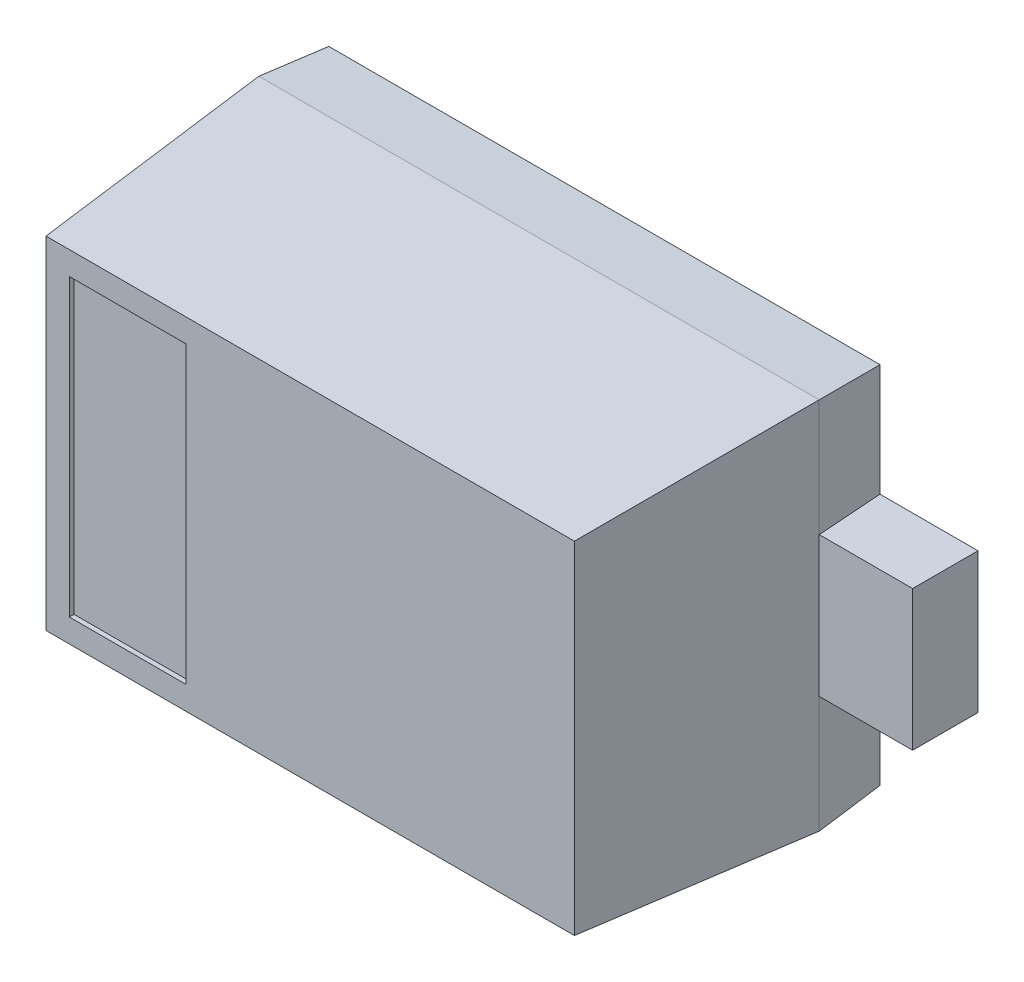
ISO-10303-21;
HEADER;
FILE_DESCRIPTION(('STEP AP214'),'2;1');
FILE_NAME('part.step','',(''),(''),'','','');
FILE_SCHEMA(('AUTOMOTIVE_DESIGN { 1 0 10303 214 1 1 1 1 }'));
ENDSEC;
DATA;
#1=APPLICATION_CONTEXT('core data for automotive mechanical design processes');
#2=APPLICATION_PROTOCOL_DEFINITION('international standard','automotive_design',2000,#1);
#3=PRODUCT_CONTEXT('',#1,'mechanical');
#4=PRODUCT('Part','Part','',(#3));
#5=PRODUCT_RELATED_PRODUCT_CATEGORY('part','',(#4));
#6=PRODUCT_DEFINITION_FORMATION('','',#4);
#7=PRODUCT_DEFINITION_CONTEXT('part definition',#1,'design');
#8=PRODUCT_DEFINITION('design','',#6,#7);
#9=PRODUCT_DEFINITION_SHAPE('','',#8);
#10=(LENGTH_UNIT() NAMED_UNIT(*) SI_UNIT(.MILLI.,.METRE.));
#11=(NAMED_UNIT(*) PLANE_ANGLE_UNIT() SI_UNIT($,.RADIAN.));
#12=(NAMED_UNIT(*) SI_UNIT($,.STERADIAN.) SOLID_ANGLE_UNIT());
#13=UNCERTAINTY_MEASURE_WITH_UNIT(LENGTH_MEASURE(1.E-05),#10,'distance_accuracy_value','');
#14=(GEOMETRIC_REPRESENTATION_CONTEXT(3) GLOBAL_UNCERTAINTY_ASSIGNED_CONTEXT((#13)) GLOBAL_UNIT_ASSIGNED_CONTEXT((#10,
#11,#12)) REPRESENTATION_CONTEXT('',''));
#15=CARTESIAN_POINT('',(0.,0.,0.));
#16=DIRECTION('',(0.,0.,1.));
#17=DIRECTION('',(1.,0.,0.));
#18=AXIS2_PLACEMENT_3D('',#15,#16,#17);
#19=CARTESIAN_POINT('',(0.8,-0.15,0.));
#20=DIRECTION('',(1.,0.,0.));
#21=DIRECTION('',(0.,0.,1.));
#22=AXIS2_PLACEMENT_3D('',#19,#20,#21);
#23=PLANE('',#22);
#24=DIRECTION('',(0.,0.,1.));
#25=VECTOR('',#24,1.);
#26=CARTESIAN_POINT('',(0.8,-0.15,0.));
#27=LINE('',#26,#25);
#28=CARTESIAN_POINT('',(0.8,-0.15,0.));
#29=VERTEX_POINT('',#28);
#30=CARTESIAN_POINT('',(0.8,-0.15,0.14));
#31=VERTEX_POINT('',#30);
#32=EDGE_CURVE('E11',#29,#31,#27,.T.);
#33=ORIENTED_EDGE('',*,*,#32,.F.);
#34=DIRECTION('',(0.,1.,0.));
#35=VECTOR('',#34,1.);
#36=CARTESIAN_POINT('',(0.8,-0.15,0.));
#37=LINE('',#36,#35);
#38=CARTESIAN_POINT('',(0.8,0.15,0.));
#39=VERTEX_POINT('',#38);
#40=EDGE_CURVE('E25',#29,#39,#37,.T.);
#41=ORIENTED_EDGE('',*,*,#40,.T.);
#42=DIRECTION('',(0.,0.,1.));
#43=VECTOR('',#42,1.);
#44=CARTESIAN_POINT('',(0.8,0.15,0.));
#45=LINE('',#44,#43);
#46=CARTESIAN_POINT('',(0.8,0.15,0.14));
#47=VERTEX_POINT('',#46);
#48=EDGE_CURVE('E418',#39,#47,#45,.T.);
#49=ORIENTED_EDGE('',*,*,#48,.T.);
#50=DIRECTION('',(0.,1.,0.));
#51=VECTOR('',#50,1.);
#52=CARTESIAN_POINT('',(0.8,-0.15,0.14));
#53=LINE('',#52,#51);
#54=EDGE_CURVE('E413',#31,#47,#53,.T.);
#55=ORIENTED_EDGE('',*,*,#54,.F.);
#56=EDGE_LOOP('',(#33,#41,#49,#55));
#57=FACE_BOUND('',#56,.T.);
#58=ADVANCED_FACE('F17',(#57),#23,.T.);
#59=CARTESIAN_POINT('',(0.590210246328,-0.15,0.14));
#60=DIRECTION('',(0.,0.,1.));
#61=DIRECTION('',(1.,0.,0.));
#62=AXIS2_PLACEMENT_3D('',#59,#60,#61);
#63=PLANE('',#62);
#64=DIRECTION('',(0.,1.,0.));
#65=VECTOR('',#64,1.);
#66=CARTESIAN_POINT('',(0.6,-0.4,0.14));
#67=LINE('',#66,#65);
#68=CARTESIAN_POINT('',(0.6,-0.15,0.14));
#69=VERTEX_POINT('',#68);
#70=CARTESIAN_POINT('',(0.6,0.15,0.14));
#71=VERTEX_POINT('',#70);
#72=EDGE_CURVE('E408',#69,#71,#67,.T.);
#73=ORIENTED_EDGE('',*,*,#72,.F.);
#74=DIRECTION('',(1.,0.,0.));
#75=VECTOR('',#74,1.);
#76=CARTESIAN_POINT('',(0.590210246328,-0.15,0.14));
#77=LINE('',#76,#75);
#78=EDGE_CURVE('E403',#69,#31,#77,.T.);
#79=ORIENTED_EDGE('',*,*,#78,.T.);
#80=ORIENTED_EDGE('',*,*,#54,.T.);
#81=DIRECTION('',(1.,0.,0.));
#82=VECTOR('',#81,1.);
#83=CARTESIAN_POINT('',(0.590210246328,0.15,0.14));
#84=LINE('',#83,#82);
#85=EDGE_CURVE('E398',#71,#47,#84,.T.);
#86=ORIENTED_EDGE('',*,*,#85,.F.);
#87=EDGE_LOOP('',(#73,#79,#80,#86));
#88=FACE_BOUND('',#87,.T.);
#89=ADVANCED_FACE('F432',(#88),#63,.T.);
#90=CARTESIAN_POINT('',(0.590210246328,0.15,0.));
#91=DIRECTION('',(0.,1.,0.));
#92=DIRECTION('',(0.,0.,1.));
#93=AXIS2_PLACEMENT_3D('',#90,#91,#92);
#94=PLANE('',#93);
#95=DIRECTION('',(1.,0.,0.));
#96=VECTOR('',#95,1.);
#97=CARTESIAN_POINT('',(0.590210246328,0.15,0.));
#98=LINE('',#97,#96);
#99=CARTESIAN_POINT('',(0.590210246328,0.15,0.));
#100=VERTEX_POINT('',#99);
#101=EDGE_CURVE('E394',#100,#39,#98,.T.);
#102=ORIENTED_EDGE('',*,*,#101,.F.);
#103=DIRECTION('',(0.0697564737434766,0.,0.99756405025987));
#104=VECTOR('',#103,1.);
#105=CARTESIAN_POINT('',(0.590210246328,0.15,0.));
#106=LINE('',#105,#104);
#107=EDGE_CURVE('E389',#100,#71,#106,.T.);
#108=ORIENTED_EDGE('',*,*,#107,.T.);
#109=ORIENTED_EDGE('',*,*,#85,.T.);
#110=ORIENTED_EDGE('',*,*,#48,.F.);
#111=EDGE_LOOP('',(#102,#108,#109,#110));
#112=FACE_BOUND('',#111,.T.);
#113=ADVANCED_FACE('F428',(#112),#94,.T.);
#114=CARTESIAN_POINT('',(0.590210246328,0.145109435353225,0.));
#115=CARTESIAN_POINT('',(0.6,0.14875,0.14));
#116=CARTESIAN_POINT('',(0.590210246328,0.390210246328,0.));
#117=CARTESIAN_POINT('',(0.6,0.4,0.14));
#118=B_SPLINE_SURFACE_WITH_KNOTS('',1,1,((#114,#115),(#116,#117)),.UNSPECIFIED.,.F.,.F.,.F.,(2,
2),(2,2),(0.54875,0.8),(0.,1.),.UNSPECIFIED.);
#119=DIRECTION('',(0.,1.,0.));
#120=VECTOR('',#119,1.);
#121=CARTESIAN_POINT('',(0.590210246328,-0.390210246328,0.));
#122=LINE('',#121,#120);
#123=CARTESIAN_POINT('',(0.590210246328,0.390210246328,0.));
#124=VERTEX_POINT('',#123);
#125=EDGE_CURVE('E385',#100,#124,#122,.T.);
#126=DIRECTION('',(0.0695873743160206,0.069587374316021,0.995145815783599));
#127=VECTOR('',#126,1.);
#128=CARTESIAN_POINT('',(0.590210246328,0.390210246328,0.));
#129=LINE('',#128,#127);
#130=CARTESIAN_POINT('',(0.6,0.4,0.14));
#131=VERTEX_POINT('',#130);
#132=EDGE_CURVE('E381',#124,#131,#129,.T.);
#133=DIRECTION('',(0.,1.,0.));
#134=VECTOR('',#133,1.);
#135=CARTESIAN_POINT('',(0.6,-0.4,0.14));
#136=LINE('',#135,#134);
#137=EDGE_CURVE('E376',#71,#131,#136,.T.);
#138=ORIENTED_EDGE('',*,*,#107,.F.);
#139=ORIENTED_EDGE('',*,*,#125,.T.);
#140=ORIENTED_EDGE('',*,*,#132,.T.);
#141=ORIENTED_EDGE('',*,*,#137,.F.);
#142=EDGE_LOOP('',(#138,#139,#140,#141));
#143=FACE_BOUND('',#142,.T.);
#144=ADVANCED_FACE('F447',(#143),#118,.T.);
#145=CARTESIAN_POINT('',(0.6,-0.4,0.14));
#146=CARTESIAN_POINT('',(0.565735862148,-0.365735862148,0.63));
#147=CARTESIAN_POINT('',(0.6,0.4,0.14));
#148=CARTESIAN_POINT('',(0.565735862148,0.365735862148,0.63));
#149=B_SPLINE_SURFACE_WITH_KNOTS('',1,1,((#145,#146),(#147,#148)),.UNSPECIFIED.,.F.,.F.,.F.,(2,
2),(2,2),(0.,0.8),(0.,1.),.UNSPECIFIED.);
#150=DIRECTION('',(0.,1.,0.));
#151=VECTOR('',#150,1.);
#152=CARTESIAN_POINT('',(0.6,-0.4,0.14));
#153=LINE('',#152,#151);
#154=CARTESIAN_POINT('',(0.6,-0.4,0.14));
#155=VERTEX_POINT('',#154);
#156=EDGE_CURVE('E371',#155,#69,#153,.T.);
#157=DIRECTION('',(-0.0695873743160209,-0.0695873743160209,0.995145815783599));
#158=VECTOR('',#157,1.);
#159=CARTESIAN_POINT('',(0.6,0.4,0.14));
#160=LINE('',#159,#158);
#161=CARTESIAN_POINT('',(0.565735862148,0.365735862148,0.63));
#162=VERTEX_POINT('',#161);
#163=EDGE_CURVE('E367',#131,#162,#160,.T.);
#164=DIRECTION('',(0.,1.,0.));
#165=VECTOR('',#164,1.);
#166=CARTESIAN_POINT('',(0.565735862148,-0.365735862148,0.63));
#167=LINE('',#166,#165);
#168=CARTESIAN_POINT('',(0.565735862148,-0.365735862148,0.63));
#169=VERTEX_POINT('',#168);
#170=EDGE_CURVE('E362',#169,#162,#167,.T.);
#171=DIRECTION('',(-0.0695873743160209,0.0695873743160209,0.995145815783599));
#172=VECTOR('',#171,1.);
#173=CARTESIAN_POINT('',(0.6,-0.4,0.14));
#174=LINE('',#173,#172);
#175=EDGE_CURVE('E357',#155,#169,#174,.T.);
#176=ORIENTED_EDGE('',*,*,#156,.T.);
#177=ORIENTED_EDGE('',*,*,#72,.T.);
#178=ORIENTED_EDGE('',*,*,#137,.T.);
#179=ORIENTED_EDGE('',*,*,#163,.T.);
#180=ORIENTED_EDGE('',*,*,#170,.F.);
#181=ORIENTED_EDGE('',*,*,#175,.F.);
#182=EDGE_LOOP('',(#176,#177,#178,#179,#180,#181));
#183=FACE_BOUND('',#182,.T.);
#184=ADVANCED_FACE('F450',(#183),#149,.T.);
#185=CARTESIAN_POINT('',(-0.6,-0.4,0.14));
#186=CARTESIAN_POINT('',(-0.565735862148,-0.365735862148,0.63));
#187=CARTESIAN_POINT('',(0.6,-0.4,0.14));
#188=CARTESIAN_POINT('',(0.565735862148,-0.365735862148,0.63));
#189=B_SPLINE_SURFACE_WITH_KNOTS('',1,1,((#185,#186),(#187,#188)),.UNSPECIFIED.,.F.,.F.,.F.,(2,
2),(2,2),(0.,1.2),(0.,1.),.UNSPECIFIED.);
#190=DIRECTION('',(1.,0.,0.));
#191=VECTOR('',#190,1.);
#192=CARTESIAN_POINT('',(-0.6,-0.4,0.14));
#193=LINE('',#192,#191);
#194=CARTESIAN_POINT('',(-0.6,-0.4,0.14));
#195=VERTEX_POINT('',#194);
#196=EDGE_CURVE('E352',#195,#155,#193,.T.);
#197=DIRECTION('',(1.,0.,0.));
#198=VECTOR('',#197,1.);
#199=CARTESIAN_POINT('',(-0.565735862148,-0.365735862148,0.63));
#200=LINE('',#199,#198);
#201=CARTESIAN_POINT('',(-0.565735862148,-0.365735862148,0.63));
#202=VERTEX_POINT('',#201);
#203=EDGE_CURVE('E347',#202,#169,#200,.T.);
#204=DIRECTION('',(0.0695873743160209,0.0695873743160209,0.995145815783599));
#205=VECTOR('',#204,1.);
#206=CARTESIAN_POINT('',(-0.6,-0.4,0.14));
#207=LINE('',#206,#205);
#208=EDGE_CURVE('E342',#195,#202,#207,.T.);
#209=ORIENTED_EDGE('',*,*,#196,.T.);
#210=ORIENTED_EDGE('',*,*,#175,.T.);
#211=ORIENTED_EDGE('',*,*,#203,.F.);
#212=ORIENTED_EDGE('',*,*,#208,.F.);
#213=EDGE_LOOP('',(#209,#210,#211,#212));
#214=FACE_BOUND('',#213,.T.);
#215=ADVANCED_FACE('F481',(#214),#189,.T.);
#216=CARTESIAN_POINT('',(-0.6,0.4,0.14));
#217=CARTESIAN_POINT('',(-0.565735862148,0.365735862148,0.63));
#218=CARTESIAN_POINT('',(-0.6,-0.4,0.14));
#219=CARTESIAN_POINT('',(-0.565735862148,-0.365735862148,0.63));
#220=B_SPLINE_SURFACE_WITH_KNOTS('',1,1,((#216,#217),(#218,#219)),.UNSPECIFIED.,.F.,.F.,.F.,(2,
2),(2,2),(0.,0.8),(0.,1.),.UNSPECIFIED.);
#221=DIRECTION('',(0.,-1.,0.));
#222=VECTOR('',#221,1.);
#223=CARTESIAN_POINT('',(-0.6,0.4,0.14));
#224=LINE('',#223,#222);
#225=CARTESIAN_POINT('',(-0.6,0.4,0.14));
#226=VERTEX_POINT('',#225);
#227=CARTESIAN_POINT('',(-0.6,0.15,0.14));
#228=VERTEX_POINT('',#227);
#229=EDGE_CURVE('E338',#226,#228,#224,.T.);
#230=DIRECTION('',(0.,-1.,0.));
#231=VECTOR('',#230,1.);
#232=CARTESIAN_POINT('',(-0.6,0.4,0.14));
#233=LINE('',#232,#231);
#234=CARTESIAN_POINT('',(-0.6,-0.15,0.14));
#235=VERTEX_POINT('',#234);
#236=EDGE_CURVE('E334',#228,#235,#233,.T.);
#237=DIRECTION('',(0.,-1.,0.));
#238=VECTOR('',#237,1.);
#239=CARTESIAN_POINT('',(-0.6,0.4,0.14));
#240=LINE('',#239,#238);
#241=EDGE_CURVE('E329',#235,#195,#240,.T.);
#242=DIRECTION('',(0.,-1.,0.));
#243=VECTOR('',#242,1.);
#244=CARTESIAN_POINT('',(-0.565735862148,0.365735862148,0.63));
#245=LINE('',#244,#243);
#246=CARTESIAN_POINT('',(-0.565735862148,0.365735862148,0.63));
#247=VERTEX_POINT('',#246);
#248=EDGE_CURVE('E324',#247,#202,#245,.T.);
#249=DIRECTION('',(0.0695873743160209,-0.0695873743160209,0.995145815783599));
#250=VECTOR('',#249,1.);
#251=CARTESIAN_POINT('',(-0.6,0.4,0.14));
#252=LINE('',#251,#250);
#253=EDGE_CURVE('E319',#226,#247,#252,.T.);
#254=ORIENTED_EDGE('',*,*,#229,.T.);
#255=ORIENTED_EDGE('',*,*,#236,.T.);
#256=ORIENTED_EDGE('',*,*,#241,.T.);
#257=ORIENTED_EDGE('',*,*,#208,.T.);
#258=ORIENTED_EDGE('',*,*,#248,.F.);
#259=ORIENTED_EDGE('',*,*,#253,.F.);
#260=EDGE_LOOP('',(#254,#255,#256,#257,#258,#259));
#261=FACE_BOUND('',#260,.T.);
#262=ADVANCED_FACE('F483',(#261),#220,.T.);
#263=CARTESIAN_POINT('',(0.6,0.4,0.14));
#264=CARTESIAN_POINT('',(0.565735862148,0.365735862148,0.63));
#265=CARTESIAN_POINT('',(-0.6,0.4,0.14));
#266=CARTESIAN_POINT('',(-0.565735862148,0.365735862148,0.63));
#267=B_SPLINE_SURFACE_WITH_KNOTS('',1,1,((#263,#264),(#265,#266)),.UNSPECIFIED.,.F.,.F.,.F.,(2,
2),(2,2),(0.,1.2),(0.,1.),.UNSPECIFIED.);
#268=DIRECTION('',(-1.,0.,0.));
#269=VECTOR('',#268,1.);
#270=CARTESIAN_POINT('',(0.6,0.4,0.14));
#271=LINE('',#270,#269);
#272=EDGE_CURVE('E314',#131,#226,#271,.T.);
#273=DIRECTION('',(-1.,0.,0.));
#274=VECTOR('',#273,1.);
#275=CARTESIAN_POINT('',(0.565735862148,0.365735862148,0.63));
#276=LINE('',#275,#274);
#277=EDGE_CURVE('E309',#162,#247,#276,.T.);
#278=ORIENTED_EDGE('',*,*,#272,.T.);
#279=ORIENTED_EDGE('',*,*,#253,.T.);
#280=ORIENTED_EDGE('',*,*,#277,.F.);
#281=ORIENTED_EDGE('',*,*,#163,.F.);
#282=EDGE_LOOP('',(#278,#279,#280,#281));
#283=FACE_BOUND('',#282,.T.);
#284=ADVANCED_FACE('F476',(#283),#267,.T.);
#285=CARTESIAN_POINT('',(-0.565735862148,-0.365735862148,0.63));
#286=DIRECTION('',(0.,0.,-1.));
#287=DIRECTION('',(0.839792508325892,0.54290749024093,0.));
#288=AXIS2_PLACEMENT_3D('',#285,#286,#287);
#289=PLANE('',#288);
#290=ORIENTED_EDGE('',*,*,#170,.T.);
#291=ORIENTED_EDGE('',*,*,#277,.T.);
#292=ORIENTED_EDGE('',*,*,#248,.T.);
#293=ORIENTED_EDGE('',*,*,#203,.T.);
#294=EDGE_LOOP('',(#290,#291,#292,#293));
#295=FACE_BOUND('',#294,.T.);
#296=DIRECTION('',(1.,0.,0.));
#297=VECTOR('',#296,1.);
#298=CARTESIAN_POINT('',(-0.540735862148,-0.315735862148,0.63));
#299=LINE('',#298,#297);
#300=CARTESIAN_POINT('',(-0.515735862148,-0.315735862148,0.63));
#301=VERTEX_POINT('',#300);
#302=CARTESIAN_POINT('',(-0.265735862148,-0.315735862148,0.63));
#303=VERTEX_POINT('',#302);
#304=EDGE_CURVE('E304',#301,#303,#299,.T.);
#305=ORIENTED_EDGE('',*,*,#304,.F.);
#306=DIRECTION('',(0.,-1.,0.));
#307=VECTOR('',#306,1.);
#308=CARTESIAN_POINT('',(-0.515735862148,-0.340735862148,0.63));
#309=LINE('',#308,#307);
#310=CARTESIAN_POINT('',(-0.515735862148,0.315735862148,0.63));
#311=VERTEX_POINT('',#310);
#312=EDGE_CURVE('E299',#311,#301,#309,.T.);
#313=ORIENTED_EDGE('',*,*,#312,.F.);
#314=DIRECTION('',(1.,0.,0.));
#315=VECTOR('',#314,1.);
#316=CARTESIAN_POINT('',(-0.540735862148,0.315735862148,0.63));
#317=LINE('',#316,#315);
#318=CARTESIAN_POINT('',(-0.265735862148,0.315735862148,0.63));
#319=VERTEX_POINT('',#318);
#320=EDGE_CURVE('E295',#311,#319,#317,.T.);
#321=ORIENTED_EDGE('',*,*,#320,.T.);
#322=DIRECTION('',(0.,-1.,0.));
#323=VECTOR('',#322,1.);
#324=CARTESIAN_POINT('',(-0.265735862148,-0.340735862148,0.63));
#325=LINE('',#324,#323);
#326=EDGE_CURVE('E291',#319,#303,#325,.T.);
#327=ORIENTED_EDGE('',*,*,#326,.T.);
#328=EDGE_LOOP('',(#305,#313,#321,#327));
#329=FACE_BOUND('',#328,.T.);
#330=ADVANCED_FACE('F478',(#295,#329),#289,.F.);
#331=CARTESIAN_POINT('',(-0.265735862148,-0.315735862148,0.62));
#332=DIRECTION('',(1.,0.,0.));
#333=DIRECTION('',(0.,0.,1.));
#334=AXIS2_PLACEMENT_3D('',#331,#332,#333);
#335=PLANE('',#334);
#336=ORIENTED_EDGE('',*,*,#326,.F.);
#337=DIRECTION('',(0.,0.,1.));
#338=VECTOR('',#337,1.);
#339=CARTESIAN_POINT('',(-0.265735862148,0.315735862148,0.62));
#340=LINE('',#339,#338);
#341=CARTESIAN_POINT('',(-0.265735862148,0.315735862148,0.62));
#342=VERTEX_POINT('',#341);
#343=EDGE_CURVE('E286',#342,#319,#340,.T.);
#344=ORIENTED_EDGE('',*,*,#343,.F.);
#345=DIRECTION('',(0.,1.,0.));
#346=VECTOR('',#345,1.);
#347=CARTESIAN_POINT('',(-0.265735862148,-0.315735862148,0.62));
#348=LINE('',#347,#346);
#349=CARTESIAN_POINT('',(-0.265735862148,-0.315735862148,0.62));
#350=VERTEX_POINT('',#349);
#351=EDGE_CURVE('E281',#350,#342,#348,.T.);
#352=ORIENTED_EDGE('',*,*,#351,.F.);
#353=DIRECTION('',(0.,0.,1.));
#354=VECTOR('',#353,1.);
#355=CARTESIAN_POINT('',(-0.265735862148,-0.315735862148,0.62));
#356=LINE('',#355,#354);
#357=EDGE_CURVE('E276',#350,#303,#356,.T.);
#358=ORIENTED_EDGE('',*,*,#357,.T.);
#359=EDGE_LOOP('',(#336,#344,#352,#358));
#360=FACE_BOUND('',#359,.T.);
#361=ADVANCED_FACE('F552',(#360),#335,.F.);
#362=CARTESIAN_POINT('',(-0.515735862148,-0.315735862148,0.62));
#363=DIRECTION('',(0.,1.,0.));
#364=DIRECTION('',(0.,0.,1.));
#365=AXIS2_PLACEMENT_3D('',#362,#363,#364);
#366=PLANE('',#365);
#367=ORIENTED_EDGE('',*,*,#357,.F.);
#368=DIRECTION('',(1.,0.,0.));
#369=VECTOR('',#368,1.);
#370=CARTESIAN_POINT('',(-0.515735862148,-0.315735862148,0.62));
#371=LINE('',#370,#369);
#372=CARTESIAN_POINT('',(-0.515735862148,-0.315735862148,0.62));
#373=VERTEX_POINT('',#372);
#374=EDGE_CURVE('E271',#373,#350,#371,.T.);
#375=ORIENTED_EDGE('',*,*,#374,.F.);
#376=DIRECTION('',(0.,0.,1.));
#377=VECTOR('',#376,1.);
#378=CARTESIAN_POINT('',(-0.515735862148,-0.315735862148,0.62));
#379=LINE('',#378,#377);
#380=EDGE_CURVE('E266',#373,#301,#379,.T.);
#381=ORIENTED_EDGE('',*,*,#380,.T.);
#382=ORIENTED_EDGE('',*,*,#304,.T.);
#383=EDGE_LOOP('',(#367,#375,#381,#382));
#384=FACE_BOUND('',#383,.T.);
#385=ADVANCED_FACE('F555',(#384),#366,.T.);
#386=CARTESIAN_POINT('',(-0.515735862148,-0.315735862148,0.62));
#387=DIRECTION('',(1.,0.,0.));
#388=DIRECTION('',(0.,0.,1.));
#389=AXIS2_PLACEMENT_3D('',#386,#387,#388);
#390=PLANE('',#389);
#391=ORIENTED_EDGE('',*,*,#380,.F.);
#392=DIRECTION('',(0.,1.,0.));
#393=VECTOR('',#392,1.);
#394=CARTESIAN_POINT('',(-0.515735862148,-0.315735862148,0.62));
#395=LINE('',#394,#393);
#396=CARTESIAN_POINT('',(-0.515735862148,0.315735862148,0.62));
#397=VERTEX_POINT('',#396);
#398=EDGE_CURVE('E262',#373,#397,#395,.T.);
#399=ORIENTED_EDGE('',*,*,#398,.T.);
#400=DIRECTION('',(0.,0.,1.));
#401=VECTOR('',#400,1.);
#402=CARTESIAN_POINT('',(-0.515735862148,0.315735862148,0.62));
#403=LINE('',#402,#401);
#404=EDGE_CURVE('E257',#397,#311,#403,.T.);
#405=ORIENTED_EDGE('',*,*,#404,.T.);
#406=ORIENTED_EDGE('',*,*,#312,.T.);
#407=EDGE_LOOP('',(#391,#399,#405,#406));
#408=FACE_BOUND('',#407,.T.);
#409=ADVANCED_FACE('F559',(#408),#390,.T.);
#410=CARTESIAN_POINT('',(-0.515735862148,0.315735862148,0.62));
#411=DIRECTION('',(0.,1.,0.));
#412=DIRECTION('',(0.,0.,1.));
#413=AXIS2_PLACEMENT_3D('',#410,#411,#412);
#414=PLANE('',#413);
#415=ORIENTED_EDGE('',*,*,#320,.F.);
#416=ORIENTED_EDGE('',*,*,#404,.F.);
#417=DIRECTION('',(1.,0.,0.));
#418=VECTOR('',#417,1.);
#419=CARTESIAN_POINT('',(-0.515735862148,0.315735862148,0.62));
#420=LINE('',#419,#418);
#421=EDGE_CURVE('E252',#397,#342,#420,.T.);
#422=ORIENTED_EDGE('',*,*,#421,.T.);
#423=ORIENTED_EDGE('',*,*,#343,.T.);
#424=EDGE_LOOP('',(#415,#416,#422,#423));
#425=FACE_BOUND('',#424,.T.);
#426=ADVANCED_FACE('F563',(#425),#414,.F.);
#427=CARTESIAN_POINT('',(-0.515735862148,-0.315735862148,0.62));
#428=DIRECTION('',(0.,0.,1.));
#429=DIRECTION('',(1.,0.,0.));
#430=AXIS2_PLACEMENT_3D('',#427,#428,#429);
#431=PLANE('',#430);
#432=ORIENTED_EDGE('',*,*,#398,.F.);
#433=ORIENTED_EDGE('',*,*,#374,.T.);
#434=ORIENTED_EDGE('',*,*,#351,.T.);
#435=ORIENTED_EDGE('',*,*,#421,.F.);
#436=EDGE_LOOP('',(#432,#433,#434,#435));
#437=FACE_BOUND('',#436,.T.);
#438=ADVANCED_FACE('F567',(#437),#431,.T.);
#439=CARTESIAN_POINT('',(0.590210246328,0.390210246328,0.));
#440=CARTESIAN_POINT('',(0.6,0.4,0.14));
#441=CARTESIAN_POINT('',(-0.590210246328,0.390210246328,0.));
#442=CARTESIAN_POINT('',(-0.6,0.4,0.14));
#443=B_SPLINE_SURFACE_WITH_KNOTS('',1,1,((#439,#440),(#441,#442)),.UNSPECIFIED.,.F.,.F.,.F.,(2,
2),(2,2),(0.,1.2),(0.,1.),.UNSPECIFIED.);
#444=DIRECTION('',(-1.,0.,0.));
#445=VECTOR('',#444,1.);
#446=CARTESIAN_POINT('',(0.590210246328,0.390210246328,0.));
#447=LINE('',#446,#445);
#448=CARTESIAN_POINT('',(-0.590210246328,0.390210246328,0.));
#449=VERTEX_POINT('',#448);
#450=EDGE_CURVE('E248',#124,#449,#447,.T.);
#451=DIRECTION('',(-0.0695873743160206,0.069587374316021,0.995145815783599));
#452=VECTOR('',#451,1.);
#453=CARTESIAN_POINT('',(-0.590210246328,0.390210246328,0.));
#454=LINE('',#453,#452);
#455=EDGE_CURVE('E243',#449,#226,#454,.T.);
#456=ORIENTED_EDGE('',*,*,#450,.T.);
#457=ORIENTED_EDGE('',*,*,#455,.T.);
#458=ORIENTED_EDGE('',*,*,#272,.F.);
#459=ORIENTED_EDGE('',*,*,#132,.F.);
#460=EDGE_LOOP('',(#456,#457,#458,#459));
#461=FACE_BOUND('',#460,.T.);
#462=ADVANCED_FACE('F474',(#461),#443,.T.);
#463=CARTESIAN_POINT('',(-0.590210246328,0.390210246328,0.));
#464=CARTESIAN_POINT('',(-0.6,0.4,0.14));
#465=CARTESIAN_POINT('',(-0.590210246328,0.145109435353225,0.));
#466=CARTESIAN_POINT('',(-0.6,0.14875,0.14));
#467=B_SPLINE_SURFACE_WITH_KNOTS('',1,1,((#463,#464),(#465,#466)),.UNSPECIFIED.,.F.,.F.,.F.,(2,
2),(2,2),(0.,0.25125),(0.,1.),.UNSPECIFIED.);
#468=DIRECTION('',(0.,-1.,0.));
#469=VECTOR('',#468,1.);
#470=CARTESIAN_POINT('',(-0.590210246328,0.390210246328,0.));
#471=LINE('',#470,#469);
#472=CARTESIAN_POINT('',(-0.590210246328,0.15,0.));
#473=VERTEX_POINT('',#472);
#474=EDGE_CURVE('E239',#449,#473,#471,.T.);
#475=DIRECTION('',(-0.0697564737434766,0.,0.99756405025987));
#476=VECTOR('',#475,1.);
#477=CARTESIAN_POINT('',(-0.590210246328,0.15,0.));
#478=LINE('',#477,#476);
#479=EDGE_CURVE('E234',#473,#228,#478,.T.);
#480=ORIENTED_EDGE('',*,*,#455,.F.);
#481=ORIENTED_EDGE('',*,*,#474,.T.);
#482=ORIENTED_EDGE('',*,*,#479,.T.);
#483=ORIENTED_EDGE('',*,*,#229,.F.);
#484=EDGE_LOOP('',(#480,#481,#482,#483));
#485=FACE_BOUND('',#484,.T.);
#486=ADVANCED_FACE('F472',(#485),#467,.T.);
#487=CARTESIAN_POINT('',(-0.590210246328,0.15,0.));
#488=DIRECTION('',(0.,-1.,0.));
#489=DIRECTION('',(0.,0.,1.));
#490=AXIS2_PLACEMENT_3D('',#487,#488,#489);
#491=PLANE('',#490);
#492=DIRECTION('',(0.,0.,1.));
#493=VECTOR('',#492,1.);
#494=CARTESIAN_POINT('',(-0.8,0.15,0.));
#495=LINE('',#494,#493);
#496=CARTESIAN_POINT('',(-0.8,0.15,0.));
#497=VERTEX_POINT('',#496);
#498=CARTESIAN_POINT('',(-0.8,0.15,0.14));
#499=VERTEX_POINT('',#498);
#500=EDGE_CURVE('E230',#497,#499,#495,.T.);
#501=ORIENTED_EDGE('',*,*,#500,.T.);
#502=DIRECTION('',(-1.,0.,0.));
#503=VECTOR('',#502,1.);
#504=CARTESIAN_POINT('',(-0.590210246328,0.15,0.14));
#505=LINE('',#504,#503);
#506=EDGE_CURVE('E157',#228,#499,#505,.T.);
#507=ORIENTED_EDGE('',*,*,#506,.F.);
#508=ORIENTED_EDGE('',*,*,#479,.F.);
#509=DIRECTION('',(-1.,0.,0.));
#510=VECTOR('',#509,1.);
#511=CARTESIAN_POINT('',(-0.590210246328,0.15,0.));
#512=LINE('',#511,#510);
#513=EDGE_CURVE('E223',#473,#497,#512,.T.);
#514=ORIENTED_EDGE('',*,*,#513,.T.);
#515=EDGE_LOOP('',(#501,#507,#508,#514));
#516=FACE_BOUND('',#515,.T.);
#517=ADVANCED_FACE('F485',(#516),#491,.F.);
#518=CARTESIAN_POINT('',(-0.590210246328,0.15,0.));
#519=DIRECTION('',(0.,0.,1.));
#520=DIRECTION('',(-1.,0.,0.));
#521=AXIS2_PLACEMENT_3D('',#518,#519,#520);
#522=PLANE('',#521);
#523=DIRECTION('',(-1.,0.,0.));
#524=VECTOR('',#523,1.);
#525=CARTESIAN_POINT('',(-0.590210246328,-0.15,0.));
#526=LINE('',#525,#524);
#527=CARTESIAN_POINT('',(-0.590210246328,-0.15,0.));
#528=VERTEX_POINT('',#527);
#529=CARTESIAN_POINT('',(-0.8,-0.15,0.));
#530=VERTEX_POINT('',#529);
#531=EDGE_CURVE('E219',#528,#530,#526,.T.);
#532=ORIENTED_EDGE('',*,*,#531,.T.);
#533=DIRECTION('',(0.,-1.,0.));
#534=VECTOR('',#533,1.);
#535=CARTESIAN_POINT('',(-0.8,0.15,0.));
#536=LINE('',#535,#534);
#537=EDGE_CURVE('E163',#497,#530,#536,.T.);
#538=ORIENTED_EDGE('',*,*,#537,.F.);
#539=ORIENTED_EDGE('',*,*,#513,.F.);
#540=DIRECTION('',(0.,-1.,0.));
#541=VECTOR('',#540,1.);
#542=CARTESIAN_POINT('',(-0.590210246328,0.15,0.));
#543=LINE('',#542,#541);
#544=EDGE_CURVE('E212',#473,#528,#543,.T.);
#545=ORIENTED_EDGE('',*,*,#544,.T.);
#546=EDGE_LOOP('',(#532,#538,#539,#545));
#547=FACE_BOUND('',#546,.T.);
#548=ADVANCED_FACE('F466',(#547),#522,.F.);
#549=CARTESIAN_POINT('',(-0.590210246328,-0.390210246328,0.));
#550=DIRECTION('',(0.,0.,-1.));
#551=DIRECTION('',(0.834172834623971,0.551503111482981,0.));
#552=AXIS2_PLACEMENT_3D('',#549,#550,#551);
#553=PLANE('',#552);
#554=DIRECTION('',(1.,0.,0.));
#555=VECTOR('',#554,1.);
#556=CARTESIAN_POINT('',(-0.590210246328,-0.390210246328,0.));
#557=LINE('',#556,#555);
#558=CARTESIAN_POINT('',(-0.590210246328,-0.390210246328,0.));
#559=VERTEX_POINT('',#558);
#560=CARTESIAN_POINT('',(0.590210246328,-0.390210246328,0.));
#561=VERTEX_POINT('',#560);
#562=EDGE_CURVE('E207',#559,#561,#557,.T.);
#563=ORIENTED_EDGE('',*,*,#562,.F.);
#564=DIRECTION('',(0.,-1.,0.));
#565=VECTOR('',#564,1.);
#566=CARTESIAN_POINT('',(-0.590210246328,0.390210246328,0.));
#567=LINE('',#566,#565);
#568=EDGE_CURVE('E202',#528,#559,#567,.T.);
#569=ORIENTED_EDGE('',*,*,#568,.F.);
#570=ORIENTED_EDGE('',*,*,#544,.F.);
#571=ORIENTED_EDGE('',*,*,#474,.F.);
#572=ORIENTED_EDGE('',*,*,#450,.F.);
#573=ORIENTED_EDGE('',*,*,#125,.F.);
#574=DIRECTION('',(0.,1.,0.));
#575=VECTOR('',#574,1.);
#576=CARTESIAN_POINT('',(0.590210246328,-0.15,0.));
#577=LINE('',#576,#575);
#578=CARTESIAN_POINT('',(0.590210246328,-0.15,0.));
#579=VERTEX_POINT('',#578);
#580=EDGE_CURVE('E197',#579,#100,#577,.T.);
#581=ORIENTED_EDGE('',*,*,#580,.F.);
#582=DIRECTION('',(0.,1.,0.));
#583=VECTOR('',#582,1.);
#584=CARTESIAN_POINT('',(0.590210246328,-0.390210246328,0.));
#585=LINE('',#584,#583);
#586=EDGE_CURVE('E192',#561,#579,#585,.T.);
#587=ORIENTED_EDGE('',*,*,#586,.F.);
#588=EDGE_LOOP('',(#563,#569,#570,#571,#572,#573,#581,#587));
#589=FACE_BOUND('',#588,.T.);
#590=ADVANCED_FACE('F443',(#589),#553,.T.);
#591=CARTESIAN_POINT('',(0.590210246328,-0.390210246328,0.));
#592=CARTESIAN_POINT('',(0.6,-0.4,0.14));
#593=CARTESIAN_POINT('',(0.590210246328,-0.145109435353225,0.));
#594=CARTESIAN_POINT('',(0.6,-0.14875,0.14));
#595=B_SPLINE_SURFACE_WITH_KNOTS('',1,1,((#591,#592),(#593,#594)),.UNSPECIFIED.,.F.,.F.,.F.,(2,
2),(2,2),(0.,0.25125),(0.,1.),.UNSPECIFIED.);
#596=DIRECTION('',(0.0695873743160206,-0.069587374316021,0.995145815783599));
#597=VECTOR('',#596,1.);
#598=CARTESIAN_POINT('',(0.590210246328,-0.390210246328,0.));
#599=LINE('',#598,#597);
#600=EDGE_CURVE('E187',#561,#155,#599,.T.);
#601=DIRECTION('',(0.0697564737434766,0.,0.99756405025987));
#602=VECTOR('',#601,1.);
#603=CARTESIAN_POINT('',(0.590210246328,-0.15,0.));
#604=LINE('',#603,#602);
#605=EDGE_CURVE('E182',#579,#69,#604,.T.);
#606=ORIENTED_EDGE('',*,*,#600,.F.);
#607=ORIENTED_EDGE('',*,*,#586,.T.);
#608=ORIENTED_EDGE('',*,*,#605,.T.);
#609=ORIENTED_EDGE('',*,*,#156,.F.);
#610=EDGE_LOOP('',(#606,#607,#608,#609));
#611=FACE_BOUND('',#610,.T.);
#612=ADVANCED_FACE('F456',(#611),#595,.T.);
#613=CARTESIAN_POINT('',(0.590210246328,-0.15,0.));
#614=DIRECTION('',(0.,1.,0.));
#615=DIRECTION('',(0.,0.,1.));
#616=AXIS2_PLACEMENT_3D('',#613,#614,#615);
#617=PLANE('',#616);
#618=ORIENTED_EDGE('',*,*,#32,.T.);
#619=ORIENTED_EDGE('',*,*,#78,.F.);
#620=ORIENTED_EDGE('',*,*,#605,.F.);
#621=DIRECTION('',(1.,0.,0.));
#622=VECTOR('',#621,1.);
#623=CARTESIAN_POINT('',(0.590210246328,-0.15,0.));
#624=LINE('',#623,#622);
#625=EDGE_CURVE('E178',#579,#29,#624,.T.);
#626=ORIENTED_EDGE('',*,*,#625,.T.);
#627=EDGE_LOOP('',(#618,#619,#620,#626));
#628=FACE_BOUND('',#627,.T.);
#629=ADVANCED_FACE('F436',(#628),#617,.F.);
#630=CARTESIAN_POINT('',(0.590210246328,-0.15,0.));
#631=DIRECTION('',(0.,0.,1.));
#632=DIRECTION('',(1.,0.,0.));
#633=AXIS2_PLACEMENT_3D('',#630,#631,#632);
#634=PLANE('',#633);
#635=ORIENTED_EDGE('',*,*,#101,.T.);
#636=ORIENTED_EDGE('',*,*,#40,.F.);
#637=ORIENTED_EDGE('',*,*,#625,.F.);
#638=ORIENTED_EDGE('',*,*,#580,.T.);
#639=EDGE_LOOP('',(#635,#636,#637,#638));
#640=FACE_BOUND('',#639,.T.);
#641=ADVANCED_FACE('F439',(#640),#634,.F.);
#642=CARTESIAN_POINT('',(-0.590210246328,-0.390210246328,0.));
#643=CARTESIAN_POINT('',(-0.6,-0.4,0.14));
#644=CARTESIAN_POINT('',(0.590210246328,-0.390210246328,0.));
#645=CARTESIAN_POINT('',(0.6,-0.4,0.14));
#646=B_SPLINE_SURFACE_WITH_KNOTS('',1,1,((#642,#643),(#644,#645)),.UNSPECIFIED.,.F.,.F.,.F.,(2,
2),(2,2),(0.,1.2),(0.,1.),.UNSPECIFIED.);
#647=DIRECTION('',(-0.0695873743160206,-0.069587374316021,0.995145815783599));
#648=VECTOR('',#647,1.);
#649=CARTESIAN_POINT('',(-0.590210246328,-0.390210246328,0.));
#650=LINE('',#649,#648);
#651=EDGE_CURVE('E173',#559,#195,#650,.T.);
#652=ORIENTED_EDGE('',*,*,#562,.T.);
#653=ORIENTED_EDGE('',*,*,#600,.T.);
#654=ORIENTED_EDGE('',*,*,#196,.F.);
#655=ORIENTED_EDGE('',*,*,#651,.F.);
#656=EDGE_LOOP('',(#652,#653,#654,#655));
#657=FACE_BOUND('',#656,.T.);
#658=ADVANCED_FACE('F462',(#657),#646,.T.);
#659=CARTESIAN_POINT('',(-0.590210246328,-0.145109435353225,0.));
#660=CARTESIAN_POINT('',(-0.6,-0.14875,0.14));
#661=CARTESIAN_POINT('',(-0.590210246328,-0.390210246328,0.));
#662=CARTESIAN_POINT('',(-0.6,-0.4,0.14));
#663=B_SPLINE_SURFACE_WITH_KNOTS('',1,1,((#659,#660),(#661,#662)),.UNSPECIFIED.,.F.,.F.,.F.,(2,
2),(2,2),(0.54875,0.8),(0.,1.),.UNSPECIFIED.);
#664=DIRECTION('',(-0.0697564737434766,0.,0.99756405025987));
#665=VECTOR('',#664,1.);
#666=CARTESIAN_POINT('',(-0.590210246328,-0.15,0.));
#667=LINE('',#666,#665);
#668=EDGE_CURVE('E147',#528,#235,#667,.T.);
#669=ORIENTED_EDGE('',*,*,#668,.F.);
#670=ORIENTED_EDGE('',*,*,#568,.T.);
#671=ORIENTED_EDGE('',*,*,#651,.T.);
#672=ORIENTED_EDGE('',*,*,#241,.F.);
#673=EDGE_LOOP('',(#669,#670,#671,#672));
#674=FACE_BOUND('',#673,.T.);
#675=ADVANCED_FACE('F464',(#674),#663,.T.);
#676=CARTESIAN_POINT('',(-0.590210246328,-0.15,0.));
#677=DIRECTION('',(0.,-1.,0.));
#678=DIRECTION('',(0.,0.,1.));
#679=AXIS2_PLACEMENT_3D('',#676,#677,#678);
#680=PLANE('',#679);
#681=ORIENTED_EDGE('',*,*,#531,.F.);
#682=ORIENTED_EDGE('',*,*,#668,.T.);
#683=DIRECTION('',(-1.,0.,0.));
#684=VECTOR('',#683,1.);
#685=CARTESIAN_POINT('',(-0.590210246328,-0.15,0.14));
#686=LINE('',#685,#684);
#687=CARTESIAN_POINT('',(-0.8,-0.15,0.14));
#688=VERTEX_POINT('',#687);
#689=EDGE_CURVE('E139',#235,#688,#686,.T.);
#690=ORIENTED_EDGE('',*,*,#689,.T.);
#691=DIRECTION('',(0.,0.,1.));
#692=VECTOR('',#691,1.);
#693=CARTESIAN_POINT('',(-0.8,-0.15,0.));
#694=LINE('',#693,#692);
#695=EDGE_CURVE('E144',#530,#688,#694,.T.);
#696=ORIENTED_EDGE('',*,*,#695,.F.);
#697=EDGE_LOOP('',(#681,#682,#690,#696));
#698=FACE_BOUND('',#697,.T.);
#699=ADVANCED_FACE('F142',(#698),#680,.T.);
#700=CARTESIAN_POINT('',(-0.8,0.15,0.));
#701=DIRECTION('',(-1.,0.,0.));
#702=DIRECTION('',(0.,0.,1.));
#703=AXIS2_PLACEMENT_3D('',#700,#701,#702);
#704=PLANE('',#703);
#705=ORIENTED_EDGE('',*,*,#500,.F.);
#706=ORIENTED_EDGE('',*,*,#537,.T.);
#707=ORIENTED_EDGE('',*,*,#695,.T.);
#708=DIRECTION('',(0.,-1.,0.));
#709=VECTOR('',#708,1.);
#710=CARTESIAN_POINT('',(-0.8,0.15,0.14));
#711=LINE('',#710,#709);
#712=EDGE_CURVE('E154',#499,#688,#711,.T.);
#713=ORIENTED_EDGE('',*,*,#712,.F.);
#714=EDGE_LOOP('',(#705,#706,#707,#713));
#715=FACE_BOUND('',#714,.T.);
#716=ADVANCED_FACE('F161',(#715),#704,.T.);
#717=CARTESIAN_POINT('',(-0.590210246328,0.15,0.14));
#718=DIRECTION('',(0.,0.,1.));
#719=DIRECTION('',(-1.,0.,0.));
#720=AXIS2_PLACEMENT_3D('',#717,#718,#719);
#721=PLANE('',#720);
#722=ORIENTED_EDGE('',*,*,#236,.F.);
#723=ORIENTED_EDGE('',*,*,#506,.T.);
#724=ORIENTED_EDGE('',*,*,#712,.T.);
#725=ORIENTED_EDGE('',*,*,#689,.F.);
#726=EDGE_LOOP('',(#722,#723,#724,#725));
#727=FACE_BOUND('',#726,.T.);
#728=ADVANCED_FACE('F155',(#727),#721,.T.);
#729=CLOSED_SHELL('',(#58,#89,#113,#144,#184,#215,#262,#284,#330,#361,#385,#409,#426,#438,#462,
#486,#517,#548,#590,#612,#629,#641,#658,#675,#699,#716,#728));
#730=MANIFOLD_SOLID_BREP('B1',#729);
#731=ADVANCED_BREP_SHAPE_REPRESENTATION('',(#18,#730),#14);
#732=SHAPE_DEFINITION_REPRESENTATION(#9,#731);
ENDSEC;
END-ISO-10303-21;
